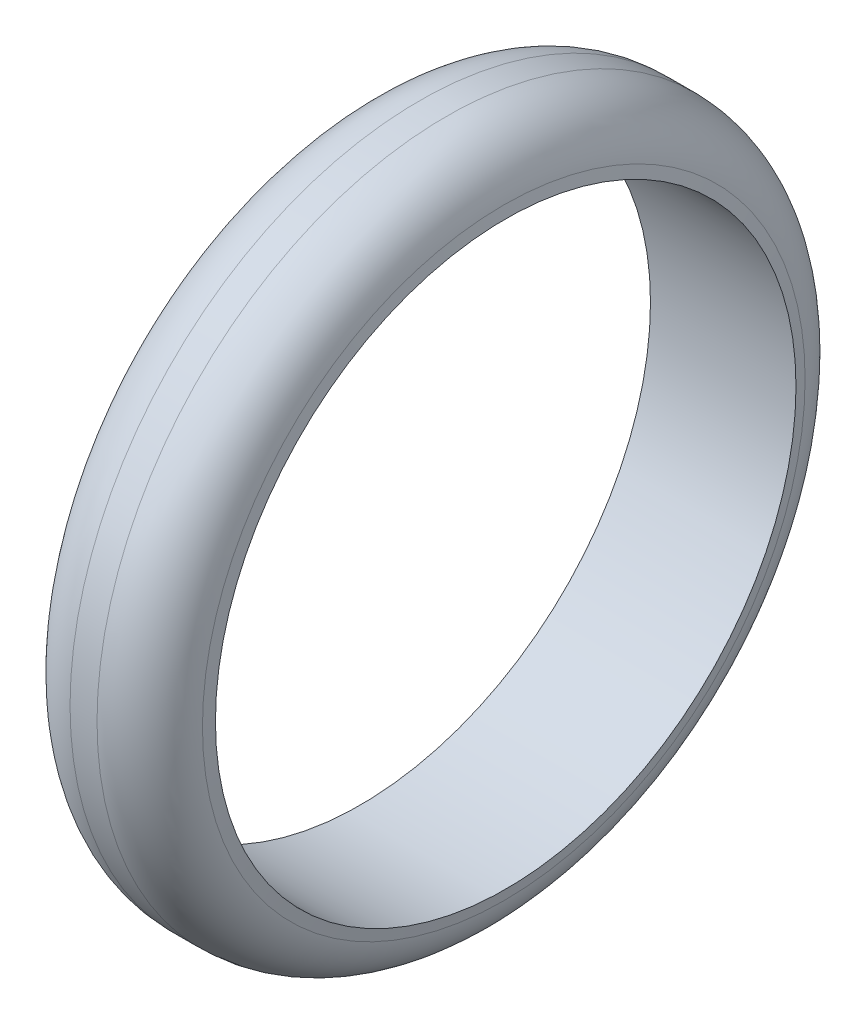
ISO-10303-21;
HEADER;
FILE_DESCRIPTION(('STEP AP214'),'2;1');
FILE_NAME('part.step','',(''),(''),'','','');
FILE_SCHEMA(('AUTOMOTIVE_DESIGN { 1 0 10303 214 1 1 1 1 }'));
ENDSEC;
DATA;
#1=APPLICATION_CONTEXT('core data for automotive mechanical design processes');
#2=APPLICATION_PROTOCOL_DEFINITION('international standard','automotive_design',2000,#1);
#3=PRODUCT_CONTEXT('',#1,'mechanical');
#4=PRODUCT('Part','Part','',(#3));
#5=PRODUCT_RELATED_PRODUCT_CATEGORY('part','',(#4));
#6=PRODUCT_DEFINITION_FORMATION('','',#4);
#7=PRODUCT_DEFINITION_CONTEXT('part definition',#1,'design');
#8=PRODUCT_DEFINITION('design','',#6,#7);
#9=PRODUCT_DEFINITION_SHAPE('','',#8);
#10=(LENGTH_UNIT() NAMED_UNIT(*) SI_UNIT(.MILLI.,.METRE.));
#11=(NAMED_UNIT(*) PLANE_ANGLE_UNIT() SI_UNIT($,.RADIAN.));
#12=(NAMED_UNIT(*) SI_UNIT($,.STERADIAN.) SOLID_ANGLE_UNIT());
#13=UNCERTAINTY_MEASURE_WITH_UNIT(LENGTH_MEASURE(1.E-05),#10,'distance_accuracy_value','');
#14=(GEOMETRIC_REPRESENTATION_CONTEXT(3) GLOBAL_UNCERTAINTY_ASSIGNED_CONTEXT((#13)) GLOBAL_UNIT_ASSIGNED_CONTEXT((#10,
#11,#12)) REPRESENTATION_CONTEXT('',''));
#15=CARTESIAN_POINT('',(0.,0.,0.));
#16=DIRECTION('',(0.,0.,1.));
#17=DIRECTION('',(1.,0.,0.));
#18=AXIS2_PLACEMENT_3D('',#15,#16,#17);
#19=CARTESIAN_POINT('',(8.56665694530617,0.,0.));
#20=DIRECTION('',(-1.,0.,0.));
#21=DIRECTION('',(0.,0.,1.));
#22=AXIS2_PLACEMENT_3D('',#19,#20,#21);
#23=CONICAL_SURFACE('',#22,48.0245602107509,1.39626340159547);
#24=CARTESIAN_POINT('',(9.73232191998555,0.,0.));
#25=DIRECTION('',(1.,0.,0.));
#26=DIRECTION('',(0.,0.,-1.));
#27=AXIS2_PLACEMENT_3D('',#24,#25,#26);
#28=CIRCLE('',#27,41.4137456320863);
#29=CARTESIAN_POINT('',(9.73232191998555,0.,-41.4137456320863));
#30=VERTEX_POINT('',#29);
#31=EDGE_CURVE('E10',#30,#30,#28,.T.);
#32=ORIENTED_EDGE('',*,*,#31,.T.);
#33=EDGE_LOOP('',(#32));
#34=FACE_BOUND('',#33,.T.);
#35=CARTESIAN_POINT('',(10.,0.,0.));
#36=DIRECTION('',(-1.,0.,0.));
#37=DIRECTION('',(0.,0.,1.));
#38=AXIS2_PLACEMENT_3D('',#35,#36,#37);
#39=CIRCLE('',#38,39.8956678033901);
#40=CARTESIAN_POINT('',(10.,0.,39.8956678033901));
#41=VERTEX_POINT('',#40);
#42=EDGE_CURVE('E52',#41,#41,#39,.T.);
#43=ORIENTED_EDGE('',*,*,#42,.T.);
#44=EDGE_LOOP('',(#43));
#45=FACE_BOUND('',#44,.T.);
#46=ADVANCED_FACE('F32',(#34,#45),#23,.T.);
#47=CARTESIAN_POINT('',(0.,0.,0.));
#48=DIRECTION('',(-1.,0.,0.));
#49=DIRECTION('',(0.,0.,1.));
#50=AXIS2_PLACEMENT_3D('',#47,#48,#49);
#51=CYLINDRICAL_SURFACE('',#50,39.8956678033901);
#52=CARTESIAN_POINT('',(-10.,0.,0.));
#53=DIRECTION('',(-1.,0.,0.));
#54=DIRECTION('',(0.,0.,1.));
#55=AXIS2_PLACEMENT_3D('',#52,#53,#54);
#56=CIRCLE('',#55,39.8956678033901);
#57=CARTESIAN_POINT('',(-10.,0.,39.8956678033901));
#58=VERTEX_POINT('',#57);
#59=EDGE_CURVE('E55',#58,#58,#56,.T.);
#60=ORIENTED_EDGE('',*,*,#59,.T.);
#61=EDGE_LOOP('',(#60));
#62=FACE_BOUND('',#61,.T.);
#63=ORIENTED_EDGE('',*,*,#42,.F.);
#64=EDGE_LOOP('',(#63));
#65=FACE_BOUND('',#64,.T.);
#66=ADVANCED_FACE('F59',(#62,#65),#51,.F.);
#67=CARTESIAN_POINT('',(-8.56665694530617,0.,0.));
#68=DIRECTION('',(1.,0.,0.));
#69=DIRECTION('',(0.,0.,-1.));
#70=AXIS2_PLACEMENT_3D('',#67,#68,#69);
#71=CONICAL_SURFACE('',#70,48.0245602107509,1.39626340159547);
#72=CARTESIAN_POINT('',(-9.73232191998558,0.,0.));
#73=DIRECTION('',(1.,0.,0.));
#74=DIRECTION('',(0.,0.,-1.));
#75=AXIS2_PLACEMENT_3D('',#72,#73,#74);
#76=CIRCLE('',#75,41.4137456320863);
#77=CARTESIAN_POINT('',(-9.73232191998558,0.,-41.4137456320863));
#78=VERTEX_POINT('',#77);
#79=EDGE_CURVE('E47',#78,#78,#76,.F.);
#80=ORIENTED_EDGE('',*,*,#79,.T.);
#81=EDGE_LOOP('',(#80));
#82=FACE_BOUND('',#81,.T.);
#83=ORIENTED_EDGE('',*,*,#59,.F.);
#84=EDGE_LOOP('',(#83));
#85=FACE_BOUND('',#84,.T.);
#86=ADVANCED_FACE('F62',(#82,#85),#71,.T.);
#87=CARTESIAN_POINT('',(0.,0.,0.));
#88=DIRECTION('',(-1.,0.,0.));
#89=DIRECTION('',(0.,0.,1.));
#90=AXIS2_PLACEMENT_3D('',#87,#88,#89);
#91=CYLINDRICAL_SURFACE('',#90,48.0245602107509);
#92=CARTESIAN_POINT('',(1.85385989588788,0.,0.));
#93=DIRECTION('',(1.,0.,0.));
#94=DIRECTION('',(0.,0.,-1.));
#95=AXIS2_PLACEMENT_3D('',#92,#93,#94);
#96=CIRCLE('',#95,48.0245602107509);
#97=CARTESIAN_POINT('',(1.85385989588788,0.,-48.0245602107509));
#98=VERTEX_POINT('',#97);
#99=EDGE_CURVE('E39',#98,#98,#96,.F.);
#100=ORIENTED_EDGE('',*,*,#99,.T.);
#101=EDGE_LOOP('',(#100));
#102=FACE_BOUND('',#101,.T.);
#103=CARTESIAN_POINT('',(-1.85385989588788,0.,0.));
#104=DIRECTION('',(1.,0.,0.));
#105=DIRECTION('',(0.,0.,-1.));
#106=AXIS2_PLACEMENT_3D('',#103,#104,#105);
#107=CIRCLE('',#106,48.0245602107509);
#108=CARTESIAN_POINT('',(-1.85385989588788,0.,-48.0245602107509));
#109=VERTEX_POINT('',#108);
#110=EDGE_CURVE('E43',#109,#109,#107,.T.);
#111=ORIENTED_EDGE('',*,*,#110,.T.);
#112=EDGE_LOOP('',(#111));
#113=FACE_BOUND('',#112,.T.);
#114=ADVANCED_FACE('F64',(#102,#113),#91,.T.);
#115=CARTESIAN_POINT('',(-1.85385989588788,0.,0.));
#116=DIRECTION('',(1.,0.,0.));
#117=DIRECTION('',(0.,0.,-1.));
#118=AXIS2_PLACEMENT_3D('',#115,#116,#117);
#119=TOROIDAL_SURFACE('',#118,40.0245602107509,8.);
#120=ORIENTED_EDGE('',*,*,#110,.F.);
#121=EDGE_LOOP('',(#120));
#122=FACE_BOUND('',#121,.T.);
#123=ORIENTED_EDGE('',*,*,#79,.F.);
#124=EDGE_LOOP('',(#123));
#125=FACE_BOUND('',#124,.T.);
#126=ADVANCED_FACE('F71',(#122,#125),#119,.T.);
#127=CARTESIAN_POINT('',(1.85385989588788,0.,0.));
#128=DIRECTION('',(1.,0.,0.));
#129=DIRECTION('',(0.,0.,-1.));
#130=AXIS2_PLACEMENT_3D('',#127,#128,#129);
#131=TOROIDAL_SURFACE('',#130,40.0245602107509,8.);
#132=ORIENTED_EDGE('',*,*,#31,.F.);
#133=EDGE_LOOP('',(#132));
#134=FACE_BOUND('',#133,.T.);
#135=ORIENTED_EDGE('',*,*,#99,.F.);
#136=EDGE_LOOP('',(#135));
#137=FACE_BOUND('',#136,.T.);
#138=ADVANCED_FACE('F34',(#134,#137),#131,.T.);
#139=CLOSED_SHELL('',(#46,#66,#86,#114,#126,#138));
#140=MANIFOLD_SOLID_BREP('B2',#139);
#141=ADVANCED_BREP_SHAPE_REPRESENTATION('',(#18,#140),#14);
#142=SHAPE_DEFINITION_REPRESENTATION(#9,#141);
ENDSEC;
END-ISO-10303-21;
